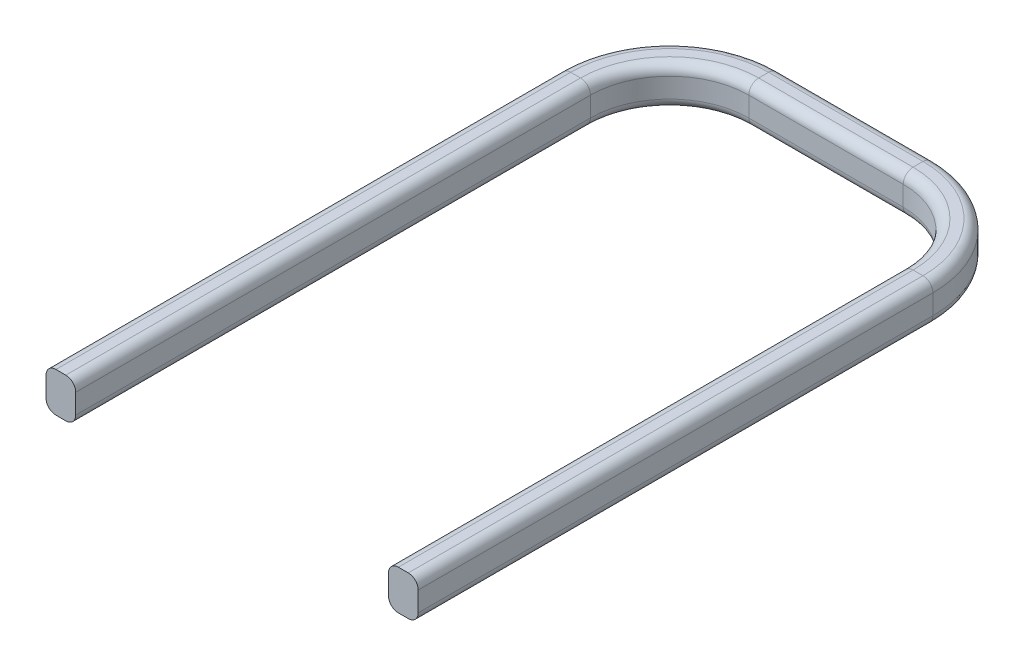
ISO-10303-21;
HEADER;
FILE_DESCRIPTION(('STEP AP214'),'2;1');
FILE_NAME('part.step','',(''),(''),'','','');
FILE_SCHEMA(('AUTOMOTIVE_DESIGN { 1 0 10303 214 1 1 1 1 }'));
ENDSEC;
DATA;
#1=APPLICATION_CONTEXT('core data for automotive mechanical design processes');
#2=APPLICATION_PROTOCOL_DEFINITION('international standard','automotive_design',2000,#1);
#3=PRODUCT_CONTEXT('',#1,'mechanical');
#4=PRODUCT('Part','Part','',(#3));
#5=PRODUCT_RELATED_PRODUCT_CATEGORY('part','',(#4));
#6=PRODUCT_DEFINITION_FORMATION('','',#4);
#7=PRODUCT_DEFINITION_CONTEXT('part definition',#1,'design');
#8=PRODUCT_DEFINITION('design','',#6,#7);
#9=PRODUCT_DEFINITION_SHAPE('','',#8);
#10=(LENGTH_UNIT() NAMED_UNIT(*) SI_UNIT(.MILLI.,.METRE.));
#11=(NAMED_UNIT(*) PLANE_ANGLE_UNIT() SI_UNIT($,.RADIAN.));
#12=(NAMED_UNIT(*) SI_UNIT($,.STERADIAN.) SOLID_ANGLE_UNIT());
#13=UNCERTAINTY_MEASURE_WITH_UNIT(LENGTH_MEASURE(1.E-05),#10,'distance_accuracy_value','');
#14=(GEOMETRIC_REPRESENTATION_CONTEXT(3) GLOBAL_UNCERTAINTY_ASSIGNED_CONTEXT((#13)) GLOBAL_UNIT_ASSIGNED_CONTEXT((#10,
#11,#12)) REPRESENTATION_CONTEXT('',''));
#15=CARTESIAN_POINT('',(0.,0.,0.));
#16=DIRECTION('',(0.,0.,1.));
#17=DIRECTION('',(1.,0.,0.));
#18=AXIS2_PLACEMENT_3D('',#15,#16,#17);
#19=CARTESIAN_POINT('',(0.,0.,0.));
#20=DIRECTION('',(0.,0.,-1.));
#21=DIRECTION('',(-1.,0.,0.));
#22=AXIS2_PLACEMENT_3D('',#19,#20,#21);
#23=PLANE('',#22);
#24=DIRECTION('',(0.,-1.,0.));
#25=VECTOR('',#24,1.);
#26=CARTESIAN_POINT('',(4.7,0.,0.));
#27=LINE('',#26,#25);
#28=CARTESIAN_POINT('',(4.7,0.75,0.));
#29=VERTEX_POINT('',#28);
#30=CARTESIAN_POINT('',(4.7,0.25,0.));
#31=VERTEX_POINT('',#30);
#32=EDGE_CURVE('E328',#29,#31,#27,.T.);
#33=ORIENTED_EDGE('',*,*,#32,.F.);
#34=CARTESIAN_POINT('',(4.45,0.75,0.));
#35=DIRECTION('',(0.,0.,-1.));
#36=DIRECTION('',(-1.,0.,0.));
#37=AXIS2_PLACEMENT_3D('',#34,#35,#36);
#38=CIRCLE('',#37,0.25);
#39=CARTESIAN_POINT('',(4.45,1.,0.));
#40=VERTEX_POINT('',#39);
#41=EDGE_CURVE('E210',#29,#40,#38,.F.);
#42=ORIENTED_EDGE('',*,*,#41,.T.);
#43=DIRECTION('',(1.,0.,0.));
#44=VECTOR('',#43,1.);
#45=CARTESIAN_POINT('',(3.95,1.,0.));
#46=LINE('',#45,#44);
#47=CARTESIAN_POINT('',(4.2,1.,0.));
#48=VERTEX_POINT('',#47);
#49=EDGE_CURVE('E324',#48,#40,#46,.T.);
#50=ORIENTED_EDGE('',*,*,#49,.F.);
#51=CARTESIAN_POINT('',(4.2,0.75,0.));
#52=DIRECTION('',(0.,0.,-1.));
#53=DIRECTION('',(-1.,0.,0.));
#54=AXIS2_PLACEMENT_3D('',#51,#52,#53);
#55=CIRCLE('',#54,0.25);
#56=CARTESIAN_POINT('',(3.95,0.75,0.));
#57=VERTEX_POINT('',#56);
#58=EDGE_CURVE('E230',#48,#57,#55,.F.);
#59=ORIENTED_EDGE('',*,*,#58,.T.);
#60=DIRECTION('',(0.,1.,0.));
#61=VECTOR('',#60,1.);
#62=CARTESIAN_POINT('',(3.95,0.,0.));
#63=LINE('',#62,#61);
#64=CARTESIAN_POINT('',(3.95,0.25,0.));
#65=VERTEX_POINT('',#64);
#66=EDGE_CURVE('E318',#65,#57,#63,.T.);
#67=ORIENTED_EDGE('',*,*,#66,.F.);
#68=CARTESIAN_POINT('',(4.2,0.25,0.));
#69=DIRECTION('',(0.,0.,-1.));
#70=DIRECTION('',(-1.,0.,0.));
#71=AXIS2_PLACEMENT_3D('',#68,#69,#70);
#72=CIRCLE('',#71,0.25);
#73=CARTESIAN_POINT('',(4.2,0.,0.));
#74=VERTEX_POINT('',#73);
#75=EDGE_CURVE('E392',#65,#74,#72,.F.);
#76=ORIENTED_EDGE('',*,*,#75,.T.);
#77=DIRECTION('',(-1.,0.,0.));
#78=VECTOR('',#77,1.);
#79=CARTESIAN_POINT('',(3.95,0.,0.));
#80=LINE('',#79,#78);
#81=CARTESIAN_POINT('',(4.45,0.,0.));
#82=VERTEX_POINT('',#81);
#83=EDGE_CURVE('E333',#82,#74,#80,.T.);
#84=ORIENTED_EDGE('',*,*,#83,.F.);
#85=CARTESIAN_POINT('',(4.45,0.25,0.));
#86=DIRECTION('',(0.,0.,-1.));
#87=DIRECTION('',(-1.,0.,0.));
#88=AXIS2_PLACEMENT_3D('',#85,#86,#87);
#89=CIRCLE('',#88,0.25);
#90=EDGE_CURVE('E394',#82,#31,#89,.F.);
#91=ORIENTED_EDGE('',*,*,#90,.T.);
#92=EDGE_LOOP('',(#33,#42,#50,#59,#67,#76,#84,#91));
#93=FACE_BOUND('',#92,.T.);
#94=ADVANCED_FACE('F34',(#93),#23,.F.);
#95=CARTESIAN_POINT('',(0.,0.,0.));
#96=DIRECTION('',(0.,0.,1.));
#97=DIRECTION('',(1.,0.,0.));
#98=AXIS2_PLACEMENT_3D('',#95,#96,#97);
#99=PLANE('',#98);
#100=DIRECTION('',(-1.,0.,0.));
#101=VECTOR('',#100,1.);
#102=CARTESIAN_POINT('',(-3.95,1.,0.));
#103=LINE('',#102,#101);
#104=CARTESIAN_POINT('',(-4.2,1.,0.));
#105=VERTEX_POINT('',#104);
#106=CARTESIAN_POINT('',(-4.45,1.,0.));
#107=VERTEX_POINT('',#106);
#108=EDGE_CURVE('E350',#105,#107,#103,.T.);
#109=ORIENTED_EDGE('',*,*,#108,.T.);
#110=CARTESIAN_POINT('',(-4.45,0.75,0.));
#111=DIRECTION('',(0.,0.,1.));
#112=DIRECTION('',(1.,0.,0.));
#113=AXIS2_PLACEMENT_3D('',#110,#111,#112);
#114=CIRCLE('',#113,0.25);
#115=CARTESIAN_POINT('',(-4.7,0.75,0.));
#116=VERTEX_POINT('',#115);
#117=EDGE_CURVE('E459',#107,#116,#114,.T.);
#118=ORIENTED_EDGE('',*,*,#117,.T.);
#119=DIRECTION('',(0.,-1.,0.));
#120=VECTOR('',#119,1.);
#121=CARTESIAN_POINT('',(-4.7,0.,0.));
#122=LINE('',#121,#120);
#123=CARTESIAN_POINT('',(-4.7,0.25,0.));
#124=VERTEX_POINT('',#123);
#125=EDGE_CURVE('E363',#116,#124,#122,.T.);
#126=ORIENTED_EDGE('',*,*,#125,.T.);
#127=CARTESIAN_POINT('',(-4.45,0.25,0.));
#128=DIRECTION('',(0.,0.,1.));
#129=DIRECTION('',(1.,0.,0.));
#130=AXIS2_PLACEMENT_3D('',#127,#128,#129);
#131=CIRCLE('',#130,0.25);
#132=CARTESIAN_POINT('',(-4.45,0.,0.));
#133=VERTEX_POINT('',#132);
#134=EDGE_CURVE('E58',#124,#133,#131,.T.);
#135=ORIENTED_EDGE('',*,*,#134,.T.);
#136=DIRECTION('',(1.,0.,0.));
#137=VECTOR('',#136,1.);
#138=CARTESIAN_POINT('',(-3.95,0.,0.));
#139=LINE('',#138,#137);
#140=CARTESIAN_POINT('',(-4.2,0.,0.));
#141=VERTEX_POINT('',#140);
#142=EDGE_CURVE('E231',#133,#141,#139,.T.);
#143=ORIENTED_EDGE('',*,*,#142,.T.);
#144=CARTESIAN_POINT('',(-4.2,0.25,0.));
#145=DIRECTION('',(0.,0.,1.));
#146=DIRECTION('',(1.,0.,0.));
#147=AXIS2_PLACEMENT_3D('',#144,#145,#146);
#148=CIRCLE('',#147,0.25);
#149=CARTESIAN_POINT('',(-3.95,0.25,0.));
#150=VERTEX_POINT('',#149);
#151=EDGE_CURVE('E456',#141,#150,#148,.T.);
#152=ORIENTED_EDGE('',*,*,#151,.T.);
#153=DIRECTION('',(0.,1.,0.));
#154=VECTOR('',#153,1.);
#155=CARTESIAN_POINT('',(-3.95,0.,0.));
#156=LINE('',#155,#154);
#157=CARTESIAN_POINT('',(-3.95,0.75,0.));
#158=VERTEX_POINT('',#157);
#159=EDGE_CURVE('E348',#150,#158,#156,.T.);
#160=ORIENTED_EDGE('',*,*,#159,.T.);
#161=CARTESIAN_POINT('',(-4.2,0.75,0.));
#162=DIRECTION('',(0.,0.,1.));
#163=DIRECTION('',(1.,0.,0.));
#164=AXIS2_PLACEMENT_3D('',#161,#162,#163);
#165=CIRCLE('',#164,0.25);
#166=EDGE_CURVE('E454',#158,#105,#165,.T.);
#167=ORIENTED_EDGE('',*,*,#166,.T.);
#168=EDGE_LOOP('',(#109,#118,#126,#135,#143,#152,#160,#167));
#169=FACE_BOUND('',#168,.T.);
#170=ADVANCED_FACE('F475',(#169),#99,.T.);
#171=CARTESIAN_POINT('',(3.95,0.,0.));
#172=DIRECTION('',(-1.,0.,0.));
#173=DIRECTION('',(0.,0.,1.));
#174=AXIS2_PLACEMENT_3D('',#171,#172,#173);
#175=PLANE('',#174);
#176=DIRECTION('',(0.,1.,0.));
#177=VECTOR('',#176,1.);
#178=CARTESIAN_POINT('',(3.95,0.,-13.));
#179=LINE('',#178,#177);
#180=CARTESIAN_POINT('',(3.95,0.25,-13.));
#181=VERTEX_POINT('',#180);
#182=CARTESIAN_POINT('',(3.95,0.75,-13.));
#183=VERTEX_POINT('',#182);
#184=EDGE_CURVE('E222',#181,#183,#179,.T.);
#185=ORIENTED_EDGE('',*,*,#184,.F.);
#186=DIRECTION('',(0.,0.,-1.));
#187=VECTOR('',#186,1.);
#188=CARTESIAN_POINT('',(3.95,0.25,0.));
#189=LINE('',#188,#187);
#190=EDGE_CURVE('E437',#181,#65,#189,.F.);
#191=ORIENTED_EDGE('',*,*,#190,.T.);
#192=ORIENTED_EDGE('',*,*,#66,.T.);
#193=DIRECTION('',(0.,0.,-1.));
#194=VECTOR('',#193,1.);
#195=CARTESIAN_POINT('',(3.95,0.75,0.));
#196=LINE('',#195,#194);
#197=EDGE_CURVE('E435',#57,#183,#196,.T.);
#198=ORIENTED_EDGE('',*,*,#197,.T.);
#199=EDGE_LOOP('',(#185,#191,#192,#198));
#200=FACE_BOUND('',#199,.T.);
#201=ADVANCED_FACE('F532',(#200),#175,.T.);
#202=CARTESIAN_POINT('',(3.95,1.,0.));
#203=DIRECTION('',(0.,1.,0.));
#204=DIRECTION('',(-1.,0.,0.));
#205=AXIS2_PLACEMENT_3D('',#202,#203,#204);
#206=PLANE('',#205);
#207=ORIENTED_EDGE('',*,*,#49,.T.);
#208=DIRECTION('',(0.,0.,-1.));
#209=VECTOR('',#208,1.);
#210=CARTESIAN_POINT('',(4.45,1.,0.));
#211=LINE('',#210,#209);
#212=CARTESIAN_POINT('',(4.45,1.,-13.));
#213=VERTEX_POINT('',#212);
#214=EDGE_CURVE('E220',#40,#213,#211,.T.);
#215=ORIENTED_EDGE('',*,*,#214,.T.);
#216=DIRECTION('',(1.,0.,0.));
#217=VECTOR('',#216,1.);
#218=CARTESIAN_POINT('',(3.95,1.,-13.));
#219=LINE('',#218,#217);
#220=CARTESIAN_POINT('',(4.2,1.,-13.));
#221=VERTEX_POINT('',#220);
#222=EDGE_CURVE('E202',#221,#213,#219,.T.);
#223=ORIENTED_EDGE('',*,*,#222,.F.);
#224=DIRECTION('',(0.,0.,-1.));
#225=VECTOR('',#224,1.);
#226=CARTESIAN_POINT('',(4.2,1.,0.));
#227=LINE('',#226,#225);
#228=EDGE_CURVE('E217',#221,#48,#227,.F.);
#229=ORIENTED_EDGE('',*,*,#228,.T.);
#230=EDGE_LOOP('',(#207,#215,#223,#229));
#231=FACE_BOUND('',#230,.T.);
#232=ADVANCED_FACE('F216',(#231),#206,.T.);
#233=CARTESIAN_POINT('',(4.7,0.,0.));
#234=DIRECTION('',(1.,0.,0.));
#235=DIRECTION('',(0.,0.,-1.));
#236=AXIS2_PLACEMENT_3D('',#233,#234,#235);
#237=PLANE('',#236);
#238=DIRECTION('',(0.,-1.,0.));
#239=VECTOR('',#238,1.);
#240=CARTESIAN_POINT('',(4.7,0.,-13.));
#241=LINE('',#240,#239);
#242=CARTESIAN_POINT('',(4.7,0.75,-13.));
#243=VERTEX_POINT('',#242);
#244=CARTESIAN_POINT('',(4.7,0.25,-13.));
#245=VERTEX_POINT('',#244);
#246=EDGE_CURVE('E221',#243,#245,#241,.T.);
#247=ORIENTED_EDGE('',*,*,#246,.F.);
#248=DIRECTION('',(0.,0.,-1.));
#249=VECTOR('',#248,1.);
#250=CARTESIAN_POINT('',(4.7,0.75,0.));
#251=LINE('',#250,#249);
#252=EDGE_CURVE('E389',#243,#29,#251,.F.);
#253=ORIENTED_EDGE('',*,*,#252,.T.);
#254=ORIENTED_EDGE('',*,*,#32,.T.);
#255=DIRECTION('',(0.,0.,-1.));
#256=VECTOR('',#255,1.);
#257=CARTESIAN_POINT('',(4.7,0.25,0.));
#258=LINE('',#257,#256);
#259=EDGE_CURVE('E386',#31,#245,#258,.T.);
#260=ORIENTED_EDGE('',*,*,#259,.T.);
#261=EDGE_LOOP('',(#247,#253,#254,#260));
#262=FACE_BOUND('',#261,.T.);
#263=ADVANCED_FACE('F502',(#262),#237,.T.);
#264=CARTESIAN_POINT('',(3.95,0.,0.));
#265=DIRECTION('',(0.,-1.,0.));
#266=DIRECTION('',(1.,0.,0.));
#267=AXIS2_PLACEMENT_3D('',#264,#265,#266);
#268=PLANE('',#267);
#269=DIRECTION('',(-1.,0.,0.));
#270=VECTOR('',#269,1.);
#271=CARTESIAN_POINT('',(3.95,0.,-13.));
#272=LINE('',#271,#270);
#273=CARTESIAN_POINT('',(4.45,0.,-13.));
#274=VERTEX_POINT('',#273);
#275=CARTESIAN_POINT('',(4.2,0.,-13.));
#276=VERTEX_POINT('',#275);
#277=EDGE_CURVE('E337',#274,#276,#272,.T.);
#278=ORIENTED_EDGE('',*,*,#277,.F.);
#279=DIRECTION('',(0.,0.,-1.));
#280=VECTOR('',#279,1.);
#281=CARTESIAN_POINT('',(4.45,0.,0.));
#282=LINE('',#281,#280);
#283=EDGE_CURVE('E421',#274,#82,#282,.F.);
#284=ORIENTED_EDGE('',*,*,#283,.T.);
#285=ORIENTED_EDGE('',*,*,#83,.T.);
#286=DIRECTION('',(0.,0.,-1.));
#287=VECTOR('',#286,1.);
#288=CARTESIAN_POINT('',(4.2,0.,0.));
#289=LINE('',#288,#287);
#290=EDGE_CURVE('E418',#74,#276,#289,.T.);
#291=ORIENTED_EDGE('',*,*,#290,.T.);
#292=EDGE_LOOP('',(#278,#284,#285,#291));
#293=FACE_BOUND('',#292,.T.);
#294=ADVANCED_FACE('F512',(#293),#268,.T.);
#295=CARTESIAN_POINT('',(1.95,0.,-13.));
#296=DIRECTION('',(0.,1.,0.));
#297=DIRECTION('',(0.,0.,1.));
#298=AXIS2_PLACEMENT_3D('',#295,#296,#297);
#299=CYLINDRICAL_SURFACE('',#298,2.);
#300=DIRECTION('',(0.,1.,0.));
#301=VECTOR('',#300,1.);
#302=CARTESIAN_POINT('',(1.95,0.,-15.));
#303=LINE('',#302,#301);
#304=CARTESIAN_POINT('',(1.95,0.25,-15.));
#305=VERTEX_POINT('',#304);
#306=CARTESIAN_POINT('',(1.95,0.75,-15.));
#307=VERTEX_POINT('',#306);
#308=EDGE_CURVE('E334',#305,#307,#303,.T.);
#309=ORIENTED_EDGE('',*,*,#308,.F.);
#310=CARTESIAN_POINT('',(1.95,0.25,-13.));
#311=DIRECTION('',(0.,-1.,0.));
#312=DIRECTION('',(0.,0.,-1.));
#313=AXIS2_PLACEMENT_3D('',#310,#311,#312);
#314=CIRCLE('',#313,2.);
#315=EDGE_CURVE('E440',#305,#181,#314,.T.);
#316=ORIENTED_EDGE('',*,*,#315,.T.);
#317=ORIENTED_EDGE('',*,*,#184,.T.);
#318=CARTESIAN_POINT('',(1.95,0.75,-13.));
#319=DIRECTION('',(0.,1.,0.));
#320=DIRECTION('',(0.,0.,1.));
#321=AXIS2_PLACEMENT_3D('',#318,#319,#320);
#322=CIRCLE('',#321,2.);
#323=EDGE_CURVE('E234',#183,#307,#322,.T.);
#324=ORIENTED_EDGE('',*,*,#323,.T.);
#325=EDGE_LOOP('',(#309,#316,#317,#324));
#326=FACE_BOUND('',#325,.T.);
#327=ADVANCED_FACE('F531',(#326),#299,.F.);
#328=CARTESIAN_POINT('',(3.95,1.,-13.));
#329=DIRECTION('',(0.,1.,0.));
#330=DIRECTION('',(0.,0.,1.));
#331=AXIS2_PLACEMENT_3D('',#328,#329,#330);
#332=PLANE('',#331);
#333=ORIENTED_EDGE('',*,*,#222,.T.);
#334=CARTESIAN_POINT('',(1.95,1.,-13.));
#335=DIRECTION('',(0.,1.,0.));
#336=DIRECTION('',(0.,0.,1.));
#337=AXIS2_PLACEMENT_3D('',#334,#335,#336);
#338=CIRCLE('',#337,2.5);
#339=CARTESIAN_POINT('',(1.95,1.,-15.5));
#340=VERTEX_POINT('',#339);
#341=EDGE_CURVE('E209',#213,#340,#338,.T.);
#342=ORIENTED_EDGE('',*,*,#341,.T.);
#343=DIRECTION('',(0.,0.,-1.));
#344=VECTOR('',#343,1.);
#345=CARTESIAN_POINT('',(1.95,1.,-15.));
#346=LINE('',#345,#344);
#347=CARTESIAN_POINT('',(1.95,1.,-15.25));
#348=VERTEX_POINT('',#347);
#349=EDGE_CURVE('E204',#348,#340,#346,.T.);
#350=ORIENTED_EDGE('',*,*,#349,.F.);
#351=CARTESIAN_POINT('',(1.95,1.,-13.));
#352=DIRECTION('',(0.,1.,0.));
#353=DIRECTION('',(0.,0.,1.));
#354=AXIS2_PLACEMENT_3D('',#351,#352,#353);
#355=CIRCLE('',#354,2.25);
#356=EDGE_CURVE('E199',#348,#221,#355,.F.);
#357=ORIENTED_EDGE('',*,*,#356,.T.);
#358=EDGE_LOOP('',(#333,#342,#350,#357));
#359=FACE_BOUND('',#358,.T.);
#360=ADVANCED_FACE('F201',(#359),#332,.T.);
#361=CARTESIAN_POINT('',(1.95,0.,-13.));
#362=DIRECTION('',(0.,1.,0.));
#363=DIRECTION('',(0.,0.,1.));
#364=AXIS2_PLACEMENT_3D('',#361,#362,#363);
#365=CYLINDRICAL_SURFACE('',#364,2.75);
#366=DIRECTION('',(0.,-1.,0.));
#367=VECTOR('',#366,1.);
#368=CARTESIAN_POINT('',(1.95,0.,-15.75));
#369=LINE('',#368,#367);
#370=CARTESIAN_POINT('',(1.95,0.75,-15.75));
#371=VERTEX_POINT('',#370);
#372=CARTESIAN_POINT('',(1.95,0.25,-15.75));
#373=VERTEX_POINT('',#372);
#374=EDGE_CURVE('E354',#371,#373,#369,.T.);
#375=ORIENTED_EDGE('',*,*,#374,.F.);
#376=CARTESIAN_POINT('',(1.95,0.75,-13.));
#377=DIRECTION('',(0.,1.,0.));
#378=DIRECTION('',(0.,0.,1.));
#379=AXIS2_PLACEMENT_3D('',#376,#377,#378);
#380=CIRCLE('',#379,2.75);
#381=EDGE_CURVE('E400',#371,#243,#380,.F.);
#382=ORIENTED_EDGE('',*,*,#381,.T.);
#383=ORIENTED_EDGE('',*,*,#246,.T.);
#384=CARTESIAN_POINT('',(1.95,0.25,-13.));
#385=DIRECTION('',(0.,-1.,0.));
#386=DIRECTION('',(0.,0.,-1.));
#387=AXIS2_PLACEMENT_3D('',#384,#385,#386);
#388=CIRCLE('',#387,2.75);
#389=EDGE_CURVE('E398',#245,#373,#388,.F.);
#390=ORIENTED_EDGE('',*,*,#389,.T.);
#391=EDGE_LOOP('',(#375,#382,#383,#390));
#392=FACE_BOUND('',#391,.T.);
#393=ADVANCED_FACE('F495',(#392),#365,.T.);
#394=CARTESIAN_POINT('',(3.95,0.,-13.));
#395=DIRECTION('',(0.,-1.,0.));
#396=DIRECTION('',(0.,0.,-1.));
#397=AXIS2_PLACEMENT_3D('',#394,#395,#396);
#398=PLANE('',#397);
#399=DIRECTION('',(0.,0.,1.));
#400=VECTOR('',#399,1.);
#401=CARTESIAN_POINT('',(1.95,0.,-15.));
#402=LINE('',#401,#400);
#403=CARTESIAN_POINT('',(1.95,0.,-15.5));
#404=VERTEX_POINT('',#403);
#405=CARTESIAN_POINT('',(1.95,0.,-15.25));
#406=VERTEX_POINT('',#405);
#407=EDGE_CURVE('E342',#404,#406,#402,.T.);
#408=ORIENTED_EDGE('',*,*,#407,.F.);
#409=CARTESIAN_POINT('',(1.95,0.,-13.));
#410=DIRECTION('',(0.,-1.,0.));
#411=DIRECTION('',(0.,0.,-1.));
#412=AXIS2_PLACEMENT_3D('',#409,#410,#411);
#413=CIRCLE('',#412,2.5);
#414=EDGE_CURVE('E425',#404,#274,#413,.T.);
#415=ORIENTED_EDGE('',*,*,#414,.T.);
#416=ORIENTED_EDGE('',*,*,#277,.T.);
#417=CARTESIAN_POINT('',(1.95,0.,-13.));
#418=DIRECTION('',(0.,-1.,0.));
#419=DIRECTION('',(0.,0.,-1.));
#420=AXIS2_PLACEMENT_3D('',#417,#418,#419);
#421=CIRCLE('',#420,2.25);
#422=EDGE_CURVE('E423',#276,#406,#421,.F.);
#423=ORIENTED_EDGE('',*,*,#422,.T.);
#424=EDGE_LOOP('',(#408,#415,#416,#423));
#425=FACE_BOUND('',#424,.T.);
#426=ADVANCED_FACE('F521',(#425),#398,.T.);
#427=CARTESIAN_POINT('',(1.94999999999999,0.,-15.));
#428=DIRECTION('',(0.,0.,1.));
#429=DIRECTION('',(1.,0.,0.));
#430=AXIS2_PLACEMENT_3D('',#427,#428,#429);
#431=PLANE('',#430);
#432=DIRECTION('',(0.,1.,0.));
#433=VECTOR('',#432,1.);
#434=CARTESIAN_POINT('',(-1.94999999999999,0.,-15.));
#435=LINE('',#434,#433);
#436=CARTESIAN_POINT('',(-1.94999999999999,0.25,-15.));
#437=VERTEX_POINT('',#436);
#438=CARTESIAN_POINT('',(-1.94999999999999,0.75,-15.));
#439=VERTEX_POINT('',#438);
#440=EDGE_CURVE('E338',#437,#439,#435,.T.);
#441=ORIENTED_EDGE('',*,*,#440,.F.);
#442=DIRECTION('',(-1.,0.,0.));
#443=VECTOR('',#442,1.);
#444=CARTESIAN_POINT('',(1.94999999999999,0.25,-15.));
#445=LINE('',#444,#443);
#446=EDGE_CURVE('E444',#437,#305,#445,.F.);
#447=ORIENTED_EDGE('',*,*,#446,.T.);
#448=ORIENTED_EDGE('',*,*,#308,.T.);
#449=DIRECTION('',(-1.,0.,0.));
#450=VECTOR('',#449,1.);
#451=CARTESIAN_POINT('',(1.94999999999999,0.75,-15.));
#452=LINE('',#451,#450);
#453=EDGE_CURVE('E442',#307,#439,#452,.T.);
#454=ORIENTED_EDGE('',*,*,#453,.T.);
#455=EDGE_LOOP('',(#441,#447,#448,#454));
#456=FACE_BOUND('',#455,.T.);
#457=ADVANCED_FACE('F529',(#456),#431,.T.);
#458=CARTESIAN_POINT('',(1.94999999999999,1.,-15.));
#459=DIRECTION('',(0.,1.,0.));
#460=DIRECTION('',(0.,0.,1.));
#461=AXIS2_PLACEMENT_3D('',#458,#459,#460);
#462=PLANE('',#461);
#463=ORIENTED_EDGE('',*,*,#349,.T.);
#464=DIRECTION('',(-1.,0.,0.));
#465=VECTOR('',#464,1.);
#466=CARTESIAN_POINT('',(1.94999999999999,1.,-15.5));
#467=LINE('',#466,#465);
#468=CARTESIAN_POINT('',(-1.94999999999999,1.,-15.5));
#469=VERTEX_POINT('',#468);
#470=EDGE_CURVE('E404',#340,#469,#467,.T.);
#471=ORIENTED_EDGE('',*,*,#470,.T.);
#472=DIRECTION('',(0.,0.,-1.));
#473=VECTOR('',#472,1.);
#474=CARTESIAN_POINT('',(-1.94999999999999,1.,-15.));
#475=LINE('',#474,#473);
#476=CARTESIAN_POINT('',(-1.94999999999999,1.,-15.25));
#477=VERTEX_POINT('',#476);
#478=EDGE_CURVE('E341',#477,#469,#475,.T.);
#479=ORIENTED_EDGE('',*,*,#478,.F.);
#480=DIRECTION('',(-1.,0.,0.));
#481=VECTOR('',#480,1.);
#482=CARTESIAN_POINT('',(1.94999999999999,1.,-15.25));
#483=LINE('',#482,#481);
#484=EDGE_CURVE('E402',#477,#348,#483,.F.);
#485=ORIENTED_EDGE('',*,*,#484,.T.);
#486=EDGE_LOOP('',(#463,#471,#479,#485));
#487=FACE_BOUND('',#486,.T.);
#488=ADVANCED_FACE('F750',(#487),#462,.T.);
#489=CARTESIAN_POINT('',(1.94999999999999,0.,-15.75));
#490=DIRECTION('',(0.,0.,-1.));
#491=DIRECTION('',(-1.,0.,0.));
#492=AXIS2_PLACEMENT_3D('',#489,#490,#491);
#493=PLANE('',#492);
#494=DIRECTION('',(0.,-1.,0.));
#495=VECTOR('',#494,1.);
#496=CARTESIAN_POINT('',(-1.94999999999999,0.,-15.75));
#497=LINE('',#496,#495);
#498=CARTESIAN_POINT('',(-1.94999999999999,0.75,-15.75));
#499=VERTEX_POINT('',#498);
#500=CARTESIAN_POINT('',(-1.94999999999999,0.25,-15.75));
#501=VERTEX_POINT('',#500);
#502=EDGE_CURVE('E357',#499,#501,#497,.T.);
#503=ORIENTED_EDGE('',*,*,#502,.F.);
#504=DIRECTION('',(-1.,0.,0.));
#505=VECTOR('',#504,1.);
#506=CARTESIAN_POINT('',(1.94999999999999,0.75,-15.75));
#507=LINE('',#506,#505);
#508=EDGE_CURVE('E408',#499,#371,#507,.F.);
#509=ORIENTED_EDGE('',*,*,#508,.T.);
#510=ORIENTED_EDGE('',*,*,#374,.T.);
#511=DIRECTION('',(-1.,0.,0.));
#512=VECTOR('',#511,1.);
#513=CARTESIAN_POINT('',(1.94999999999999,0.25,-15.75));
#514=LINE('',#513,#512);
#515=EDGE_CURVE('E406',#373,#501,#514,.T.);
#516=ORIENTED_EDGE('',*,*,#515,.T.);
#517=EDGE_LOOP('',(#503,#509,#510,#516));
#518=FACE_BOUND('',#517,.T.);
#519=ADVANCED_FACE('F493',(#518),#493,.T.);
#520=CARTESIAN_POINT('',(1.94999999999999,0.,-15.));
#521=DIRECTION('',(0.,-1.,0.));
#522=DIRECTION('',(0.,0.,-1.));
#523=AXIS2_PLACEMENT_3D('',#520,#521,#522);
#524=PLANE('',#523);
#525=DIRECTION('',(0.,0.,1.));
#526=VECTOR('',#525,1.);
#527=CARTESIAN_POINT('',(-1.94999999999999,0.,-15.));
#528=LINE('',#527,#526);
#529=CARTESIAN_POINT('',(-1.94999999999999,0.,-15.5));
#530=VERTEX_POINT('',#529);
#531=CARTESIAN_POINT('',(-1.94999999999999,0.,-15.25));
#532=VERTEX_POINT('',#531);
#533=EDGE_CURVE('E347',#530,#532,#528,.T.);
#534=ORIENTED_EDGE('',*,*,#533,.F.);
#535=DIRECTION('',(-1.,0.,0.));
#536=VECTOR('',#535,1.);
#537=CARTESIAN_POINT('',(1.94999999999999,0.,-15.5));
#538=LINE('',#537,#536);
#539=EDGE_CURVE('E429',#530,#404,#538,.F.);
#540=ORIENTED_EDGE('',*,*,#539,.T.);
#541=ORIENTED_EDGE('',*,*,#407,.T.);
#542=DIRECTION('',(-1.,0.,0.));
#543=VECTOR('',#542,1.);
#544=CARTESIAN_POINT('',(1.94999999999999,0.,-15.25));
#545=LINE('',#544,#543);
#546=EDGE_CURVE('E427',#406,#532,#545,.T.);
#547=ORIENTED_EDGE('',*,*,#546,.T.);
#548=EDGE_LOOP('',(#534,#540,#541,#547));
#549=FACE_BOUND('',#548,.T.);
#550=ADVANCED_FACE('F524',(#549),#524,.T.);
#551=CARTESIAN_POINT('',(-1.95,0.,-13.));
#552=DIRECTION('',(0.,1.,0.));
#553=DIRECTION('',(0.,0.,1.));
#554=AXIS2_PLACEMENT_3D('',#551,#552,#553);
#555=CYLINDRICAL_SURFACE('',#554,2.);
#556=DIRECTION('',(0.,1.,0.));
#557=VECTOR('',#556,1.);
#558=CARTESIAN_POINT('',(-3.95,0.,-13.));
#559=LINE('',#558,#557);
#560=CARTESIAN_POINT('',(-3.95,0.25,-13.));
#561=VERTEX_POINT('',#560);
#562=CARTESIAN_POINT('',(-3.95,0.75,-13.));
#563=VERTEX_POINT('',#562);
#564=EDGE_CURVE('E343',#561,#563,#559,.T.);
#565=ORIENTED_EDGE('',*,*,#564,.F.);
#566=CARTESIAN_POINT('',(-1.95,0.25,-13.));
#567=DIRECTION('',(0.,-1.,0.));
#568=DIRECTION('',(0.,0.,-1.));
#569=AXIS2_PLACEMENT_3D('',#566,#567,#568);
#570=CIRCLE('',#569,2.);
#571=EDGE_CURVE('E448',#561,#437,#570,.T.);
#572=ORIENTED_EDGE('',*,*,#571,.T.);
#573=ORIENTED_EDGE('',*,*,#440,.T.);
#574=CARTESIAN_POINT('',(-1.95,0.75,-13.));
#575=DIRECTION('',(0.,1.,0.));
#576=DIRECTION('',(0.,0.,1.));
#577=AXIS2_PLACEMENT_3D('',#574,#575,#576);
#578=CIRCLE('',#577,2.);
#579=EDGE_CURVE('E446',#439,#563,#578,.T.);
#580=ORIENTED_EDGE('',*,*,#579,.T.);
#581=EDGE_LOOP('',(#565,#572,#573,#580));
#582=FACE_BOUND('',#581,.T.);
#583=ADVANCED_FACE('F725',(#582),#555,.F.);
#584=CARTESIAN_POINT('',(-1.94999999999999,1.,-15.));
#585=DIRECTION('',(0.,1.,0.));
#586=DIRECTION('',(0.,0.,1.));
#587=AXIS2_PLACEMENT_3D('',#584,#585,#586);
#588=PLANE('',#587);
#589=ORIENTED_EDGE('',*,*,#478,.T.);
#590=CARTESIAN_POINT('',(-1.95,1.,-13.));
#591=DIRECTION('',(0.,1.,0.));
#592=DIRECTION('',(0.,0.,1.));
#593=AXIS2_PLACEMENT_3D('',#590,#591,#592);
#594=CIRCLE('',#593,2.5);
#595=CARTESIAN_POINT('',(-4.45,1.,-13.));
#596=VERTEX_POINT('',#595);
#597=EDGE_CURVE('E412',#469,#596,#594,.T.);
#598=ORIENTED_EDGE('',*,*,#597,.T.);
#599=DIRECTION('',(-1.,0.,0.));
#600=VECTOR('',#599,1.);
#601=CARTESIAN_POINT('',(-3.95,1.,-13.));
#602=LINE('',#601,#600);
#603=CARTESIAN_POINT('',(-4.2,1.,-13.));
#604=VERTEX_POINT('',#603);
#605=EDGE_CURVE('E346',#604,#596,#602,.T.);
#606=ORIENTED_EDGE('',*,*,#605,.F.);
#607=CARTESIAN_POINT('',(-1.95,1.,-13.));
#608=DIRECTION('',(0.,1.,0.));
#609=DIRECTION('',(0.,0.,1.));
#610=AXIS2_PLACEMENT_3D('',#607,#608,#609);
#611=CIRCLE('',#610,2.25);
#612=EDGE_CURVE('E410',#604,#477,#611,.F.);
#613=ORIENTED_EDGE('',*,*,#612,.T.);
#614=EDGE_LOOP('',(#589,#598,#606,#613));
#615=FACE_BOUND('',#614,.T.);
#616=ADVANCED_FACE('F484',(#615),#588,.T.);
#617=CARTESIAN_POINT('',(-1.95,0.,-13.));
#618=DIRECTION('',(0.,1.,0.));
#619=DIRECTION('',(0.,0.,1.));
#620=AXIS2_PLACEMENT_3D('',#617,#618,#619);
#621=CYLINDRICAL_SURFACE('',#620,2.75);
#622=DIRECTION('',(0.,-1.,0.));
#623=VECTOR('',#622,1.);
#624=CARTESIAN_POINT('',(-4.7,0.,-13.));
#625=LINE('',#624,#623);
#626=CARTESIAN_POINT('',(-4.7,0.75,-13.));
#627=VERTEX_POINT('',#626);
#628=CARTESIAN_POINT('',(-4.7,0.25,-13.));
#629=VERTEX_POINT('',#628);
#630=EDGE_CURVE('E360',#627,#629,#625,.T.);
#631=ORIENTED_EDGE('',*,*,#630,.F.);
#632=CARTESIAN_POINT('',(-1.95,0.75,-13.));
#633=DIRECTION('',(0.,1.,0.));
#634=DIRECTION('',(0.,0.,1.));
#635=AXIS2_PLACEMENT_3D('',#632,#633,#634);
#636=CIRCLE('',#635,2.75);
#637=EDGE_CURVE('E416',#627,#499,#636,.F.);
#638=ORIENTED_EDGE('',*,*,#637,.T.);
#639=ORIENTED_EDGE('',*,*,#502,.T.);
#640=CARTESIAN_POINT('',(-1.95,0.25,-13.));
#641=DIRECTION('',(0.,-1.,0.));
#642=DIRECTION('',(0.,0.,-1.));
#643=AXIS2_PLACEMENT_3D('',#640,#641,#642);
#644=CIRCLE('',#643,2.75);
#645=EDGE_CURVE('E414',#501,#629,#644,.F.);
#646=ORIENTED_EDGE('',*,*,#645,.T.);
#647=EDGE_LOOP('',(#631,#638,#639,#646));
#648=FACE_BOUND('',#647,.T.);
#649=ADVANCED_FACE('F707',(#648),#621,.T.);
#650=CARTESIAN_POINT('',(-1.94999999999999,0.,-15.));
#651=DIRECTION('',(0.,-1.,0.));
#652=DIRECTION('',(0.,0.,-1.));
#653=AXIS2_PLACEMENT_3D('',#650,#651,#652);
#654=PLANE('',#653);
#655=DIRECTION('',(1.,0.,0.));
#656=VECTOR('',#655,1.);
#657=CARTESIAN_POINT('',(-3.95,0.,-13.));
#658=LINE('',#657,#656);
#659=CARTESIAN_POINT('',(-4.45,0.,-13.));
#660=VERTEX_POINT('',#659);
#661=CARTESIAN_POINT('',(-4.2,0.,-13.));
#662=VERTEX_POINT('',#661);
#663=EDGE_CURVE('E351',#660,#662,#658,.T.);
#664=ORIENTED_EDGE('',*,*,#663,.F.);
#665=CARTESIAN_POINT('',(-1.95,0.,-13.));
#666=DIRECTION('',(0.,-1.,0.));
#667=DIRECTION('',(0.,0.,-1.));
#668=AXIS2_PLACEMENT_3D('',#665,#666,#667);
#669=CIRCLE('',#668,2.5);
#670=EDGE_CURVE('E433',#660,#530,#669,.T.);
#671=ORIENTED_EDGE('',*,*,#670,.T.);
#672=ORIENTED_EDGE('',*,*,#533,.T.);
#673=CARTESIAN_POINT('',(-1.95,0.,-13.));
#674=DIRECTION('',(0.,-1.,0.));
#675=DIRECTION('',(0.,0.,-1.));
#676=AXIS2_PLACEMENT_3D('',#673,#674,#675);
#677=CIRCLE('',#676,2.25);
#678=EDGE_CURVE('E431',#532,#662,#677,.F.);
#679=ORIENTED_EDGE('',*,*,#678,.T.);
#680=EDGE_LOOP('',(#664,#671,#672,#679));
#681=FACE_BOUND('',#680,.T.);
#682=ADVANCED_FACE('F556',(#681),#654,.T.);
#683=CARTESIAN_POINT('',(-3.95,0.,-13.));
#684=DIRECTION('',(1.,0.,0.));
#685=DIRECTION('',(0.,0.,-1.));
#686=AXIS2_PLACEMENT_3D('',#683,#684,#685);
#687=PLANE('',#686);
#688=ORIENTED_EDGE('',*,*,#159,.F.);
#689=DIRECTION('',(0.,0.,1.));
#690=VECTOR('',#689,1.);
#691=CARTESIAN_POINT('',(-3.95,0.25,-13.));
#692=LINE('',#691,#690);
#693=EDGE_CURVE('E11',#150,#561,#692,.F.);
#694=ORIENTED_EDGE('',*,*,#693,.T.);
#695=ORIENTED_EDGE('',*,*,#564,.T.);
#696=DIRECTION('',(0.,0.,1.));
#697=VECTOR('',#696,1.);
#698=CARTESIAN_POINT('',(-3.95,0.75,-13.));
#699=LINE('',#698,#697);
#700=EDGE_CURVE('E43',#563,#158,#699,.T.);
#701=ORIENTED_EDGE('',*,*,#700,.T.);
#702=EDGE_LOOP('',(#688,#694,#695,#701));
#703=FACE_BOUND('',#702,.T.);
#704=ADVANCED_FACE('F470',(#703),#687,.T.);
#705=CARTESIAN_POINT('',(-3.95,1.,-13.));
#706=DIRECTION('',(0.,1.,0.));
#707=DIRECTION('',(-1.,0.,0.));
#708=AXIS2_PLACEMENT_3D('',#705,#706,#707);
#709=PLANE('',#708);
#710=ORIENTED_EDGE('',*,*,#605,.T.);
#711=DIRECTION('',(0.,0.,1.));
#712=VECTOR('',#711,1.);
#713=CARTESIAN_POINT('',(-4.45,1.,-13.));
#714=LINE('',#713,#712);
#715=EDGE_CURVE('E452',#596,#107,#714,.T.);
#716=ORIENTED_EDGE('',*,*,#715,.T.);
#717=ORIENTED_EDGE('',*,*,#108,.F.);
#718=DIRECTION('',(0.,0.,1.));
#719=VECTOR('',#718,1.);
#720=CARTESIAN_POINT('',(-4.2,1.,-13.));
#721=LINE('',#720,#719);
#722=EDGE_CURVE('E450',#105,#604,#721,.F.);
#723=ORIENTED_EDGE('',*,*,#722,.T.);
#724=EDGE_LOOP('',(#710,#716,#717,#723));
#725=FACE_BOUND('',#724,.T.);
#726=ADVANCED_FACE('F481',(#725),#709,.T.);
#727=CARTESIAN_POINT('',(-4.7,0.,-13.));
#728=DIRECTION('',(-1.,0.,0.));
#729=DIRECTION('',(0.,0.,1.));
#730=AXIS2_PLACEMENT_3D('',#727,#728,#729);
#731=PLANE('',#730);
#732=ORIENTED_EDGE('',*,*,#125,.F.);
#733=DIRECTION('',(0.,0.,1.));
#734=VECTOR('',#733,1.);
#735=CARTESIAN_POINT('',(-4.7,0.75,-13.));
#736=LINE('',#735,#734);
#737=EDGE_CURVE('E463',#116,#627,#736,.F.);
#738=ORIENTED_EDGE('',*,*,#737,.T.);
#739=ORIENTED_EDGE('',*,*,#630,.T.);
#740=DIRECTION('',(0.,0.,1.));
#741=VECTOR('',#740,1.);
#742=CARTESIAN_POINT('',(-4.7,0.25,-13.));
#743=LINE('',#742,#741);
#744=EDGE_CURVE('E461',#629,#124,#743,.T.);
#745=ORIENTED_EDGE('',*,*,#744,.T.);
#746=EDGE_LOOP('',(#732,#738,#739,#745));
#747=FACE_BOUND('',#746,.T.);
#748=ADVANCED_FACE('F545',(#747),#731,.T.);
#749=CARTESIAN_POINT('',(-3.95,0.,-13.));
#750=DIRECTION('',(0.,-1.,0.));
#751=DIRECTION('',(1.,0.,0.));
#752=AXIS2_PLACEMENT_3D('',#749,#750,#751);
#753=PLANE('',#752);
#754=ORIENTED_EDGE('',*,*,#142,.F.);
#755=DIRECTION('',(0.,0.,1.));
#756=VECTOR('',#755,1.);
#757=CARTESIAN_POINT('',(-4.45,0.,-13.));
#758=LINE('',#757,#756);
#759=EDGE_CURVE('E466',#133,#660,#758,.F.);
#760=ORIENTED_EDGE('',*,*,#759,.T.);
#761=ORIENTED_EDGE('',*,*,#663,.T.);
#762=DIRECTION('',(0.,0.,1.));
#763=VECTOR('',#762,1.);
#764=CARTESIAN_POINT('',(-4.2,0.,-13.));
#765=LINE('',#764,#763);
#766=EDGE_CURVE('E51',#662,#141,#765,.T.);
#767=ORIENTED_EDGE('',*,*,#766,.T.);
#768=EDGE_LOOP('',(#754,#760,#761,#767));
#769=FACE_BOUND('',#768,.T.);
#770=ADVANCED_FACE('F542',(#769),#753,.T.);
#771=CARTESIAN_POINT('',(-4.45,0.75,-13.));
#772=DIRECTION('',(0.,0.,1.));
#773=DIRECTION('',(1.,0.,0.));
#774=AXIS2_PLACEMENT_3D('',#771,#772,#773);
#775=CYLINDRICAL_SURFACE('',#774,0.25);
#776=ORIENTED_EDGE('',*,*,#117,.F.);
#777=ORIENTED_EDGE('',*,*,#715,.F.);
#778=CARTESIAN_POINT('',(-4.45,0.75,-13.));
#779=DIRECTION('',(0.,0.,-1.));
#780=DIRECTION('',(-1.,0.,0.));
#781=AXIS2_PLACEMENT_3D('',#778,#779,#780);
#782=CIRCLE('',#781,0.25);
#783=EDGE_CURVE('E289',#627,#596,#782,.T.);
#784=ORIENTED_EDGE('',*,*,#783,.F.);
#785=ORIENTED_EDGE('',*,*,#737,.F.);
#786=EDGE_LOOP('',(#776,#777,#784,#785));
#787=FACE_BOUND('',#786,.T.);
#788=ADVANCED_FACE('F544',(#787),#775,.T.);
#789=CARTESIAN_POINT('',(-1.95,0.75,-13.));
#790=DIRECTION('',(0.,1.,0.));
#791=DIRECTION('',(0.,0.,1.));
#792=AXIS2_PLACEMENT_3D('',#789,#790,#791);
#793=TOROIDAL_SURFACE('',#792,2.5,0.25);
#794=ORIENTED_EDGE('',*,*,#783,.T.);
#795=ORIENTED_EDGE('',*,*,#597,.F.);
#796=CARTESIAN_POINT('',(-1.94999999999999,0.75,-15.5));
#797=DIRECTION('',(1.,0.,0.));
#798=DIRECTION('',(0.,1.,0.));
#799=AXIS2_PLACEMENT_3D('',#796,#797,#798);
#800=CIRCLE('',#799,0.25);
#801=EDGE_CURVE('E309',#499,#469,#800,.T.);
#802=ORIENTED_EDGE('',*,*,#801,.F.);
#803=ORIENTED_EDGE('',*,*,#637,.F.);
#804=EDGE_LOOP('',(#794,#795,#802,#803));
#805=FACE_BOUND('',#804,.T.);
#806=ADVANCED_FACE('F486',(#805),#793,.T.);
#807=CARTESIAN_POINT('',(1.94999999999999,0.75,-15.5));
#808=DIRECTION('',(-1.,0.,0.));
#809=DIRECTION('',(0.,0.,1.));
#810=AXIS2_PLACEMENT_3D('',#807,#808,#809);
#811=CYLINDRICAL_SURFACE('',#810,0.25);
#812=ORIENTED_EDGE('',*,*,#801,.T.);
#813=ORIENTED_EDGE('',*,*,#470,.F.);
#814=CARTESIAN_POINT('',(1.95,0.75,-15.5));
#815=DIRECTION('',(1.,0.,0.));
#816=DIRECTION('',(0.,0.,-1.));
#817=AXIS2_PLACEMENT_3D('',#814,#815,#816);
#818=CIRCLE('',#817,0.25);
#819=EDGE_CURVE('E302',#371,#340,#818,.T.);
#820=ORIENTED_EDGE('',*,*,#819,.F.);
#821=ORIENTED_EDGE('',*,*,#508,.F.);
#822=EDGE_LOOP('',(#812,#813,#820,#821));
#823=FACE_BOUND('',#822,.T.);
#824=ADVANCED_FACE('F488',(#823),#811,.T.);
#825=CARTESIAN_POINT('',(1.95,0.75,-13.));
#826=DIRECTION('',(0.,1.,0.));
#827=DIRECTION('',(0.,0.,1.));
#828=AXIS2_PLACEMENT_3D('',#825,#826,#827);
#829=TOROIDAL_SURFACE('',#828,2.5,0.25);
#830=ORIENTED_EDGE('',*,*,#819,.T.);
#831=ORIENTED_EDGE('',*,*,#341,.F.);
#832=CARTESIAN_POINT('',(4.45,0.75,-13.));
#833=DIRECTION('',(0.,0.,1.));
#834=DIRECTION('',(0.,-1.,0.));
#835=AXIS2_PLACEMENT_3D('',#832,#833,#834);
#836=CIRCLE('',#835,0.25);
#837=EDGE_CURVE('E297',#243,#213,#836,.T.);
#838=ORIENTED_EDGE('',*,*,#837,.F.);
#839=ORIENTED_EDGE('',*,*,#381,.F.);
#840=EDGE_LOOP('',(#830,#831,#838,#839));
#841=FACE_BOUND('',#840,.T.);
#842=ADVANCED_FACE('F565',(#841),#829,.T.);
#843=CARTESIAN_POINT('',(4.45,0.75,0.));
#844=DIRECTION('',(0.,0.,-1.));
#845=DIRECTION('',(-1.,0.,0.));
#846=AXIS2_PLACEMENT_3D('',#843,#844,#845);
#847=CYLINDRICAL_SURFACE('',#846,0.25);
#848=ORIENTED_EDGE('',*,*,#41,.F.);
#849=ORIENTED_EDGE('',*,*,#252,.F.);
#850=ORIENTED_EDGE('',*,*,#837,.T.);
#851=ORIENTED_EDGE('',*,*,#214,.F.);
#852=EDGE_LOOP('',(#848,#849,#850,#851));
#853=FACE_BOUND('',#852,.T.);
#854=ADVANCED_FACE('F561',(#853),#847,.T.);
#855=CARTESIAN_POINT('',(-4.45,0.25,-13.));
#856=DIRECTION('',(0.,0.,1.));
#857=DIRECTION('',(1.,0.,0.));
#858=AXIS2_PLACEMENT_3D('',#855,#856,#857);
#859=CYLINDRICAL_SURFACE('',#858,0.25);
#860=ORIENTED_EDGE('',*,*,#134,.F.);
#861=ORIENTED_EDGE('',*,*,#744,.F.);
#862=CARTESIAN_POINT('',(-4.45,0.25,-13.));
#863=DIRECTION('',(0.,0.,-1.));
#864=DIRECTION('',(-1.,0.,0.));
#865=AXIS2_PLACEMENT_3D('',#862,#863,#864);
#866=CIRCLE('',#865,0.25);
#867=EDGE_CURVE('E265',#660,#629,#866,.T.);
#868=ORIENTED_EDGE('',*,*,#867,.F.);
#869=ORIENTED_EDGE('',*,*,#759,.F.);
#870=EDGE_LOOP('',(#860,#861,#868,#869));
#871=FACE_BOUND('',#870,.T.);
#872=ADVANCED_FACE('F564',(#871),#859,.T.);
#873=CARTESIAN_POINT('',(-1.95,0.25,-13.));
#874=DIRECTION('',(0.,-1.,0.));
#875=DIRECTION('',(0.,0.,-1.));
#876=AXIS2_PLACEMENT_3D('',#873,#874,#875);
#877=TOROIDAL_SURFACE('',#876,2.5,0.25);
#878=ORIENTED_EDGE('',*,*,#867,.T.);
#879=ORIENTED_EDGE('',*,*,#645,.F.);
#880=CARTESIAN_POINT('',(-1.94999999999999,0.25,-15.5));
#881=DIRECTION('',(1.,0.,0.));
#882=DIRECTION('',(0.,0.,-1.));
#883=AXIS2_PLACEMENT_3D('',#880,#881,#882);
#884=CIRCLE('',#883,0.25);
#885=EDGE_CURVE('E286',#530,#501,#884,.T.);
#886=ORIENTED_EDGE('',*,*,#885,.F.);
#887=ORIENTED_EDGE('',*,*,#670,.F.);
#888=EDGE_LOOP('',(#878,#879,#886,#887));
#889=FACE_BOUND('',#888,.T.);
#890=ADVANCED_FACE('F581',(#889),#877,.T.);
#891=CARTESIAN_POINT('',(1.94999999999999,0.25,-15.5));
#892=DIRECTION('',(-1.,0.,0.));
#893=DIRECTION('',(0.,0.,1.));
#894=AXIS2_PLACEMENT_3D('',#891,#892,#893);
#895=CYLINDRICAL_SURFACE('',#894,0.25);
#896=ORIENTED_EDGE('',*,*,#885,.T.);
#897=ORIENTED_EDGE('',*,*,#515,.F.);
#898=CARTESIAN_POINT('',(1.95,0.25,-15.5));
#899=DIRECTION('',(1.,0.,0.));
#900=DIRECTION('',(0.,0.,-1.));
#901=AXIS2_PLACEMENT_3D('',#898,#899,#900);
#902=CIRCLE('',#901,0.25);
#903=EDGE_CURVE('E278',#404,#373,#902,.T.);
#904=ORIENTED_EDGE('',*,*,#903,.F.);
#905=ORIENTED_EDGE('',*,*,#539,.F.);
#906=EDGE_LOOP('',(#896,#897,#904,#905));
#907=FACE_BOUND('',#906,.T.);
#908=ADVANCED_FACE('F578',(#907),#895,.T.);
#909=CARTESIAN_POINT('',(1.95,0.25,-13.));
#910=DIRECTION('',(0.,-1.,0.));
#911=DIRECTION('',(0.,0.,-1.));
#912=AXIS2_PLACEMENT_3D('',#909,#910,#911);
#913=TOROIDAL_SURFACE('',#912,2.5,0.25);
#914=ORIENTED_EDGE('',*,*,#903,.T.);
#915=ORIENTED_EDGE('',*,*,#389,.F.);
#916=CARTESIAN_POINT('',(4.45,0.25,-13.));
#917=DIRECTION('',(0.,0.,1.));
#918=DIRECTION('',(1.,0.,0.));
#919=AXIS2_PLACEMENT_3D('',#916,#917,#918);
#920=CIRCLE('',#919,0.25);
#921=EDGE_CURVE('E273',#274,#245,#920,.T.);
#922=ORIENTED_EDGE('',*,*,#921,.F.);
#923=ORIENTED_EDGE('',*,*,#414,.F.);
#924=EDGE_LOOP('',(#914,#915,#922,#923));
#925=FACE_BOUND('',#924,.T.);
#926=ADVANCED_FACE('F498',(#925),#913,.T.);
#927=CARTESIAN_POINT('',(4.45,0.25,0.));
#928=DIRECTION('',(0.,0.,-1.));
#929=DIRECTION('',(-1.,0.,0.));
#930=AXIS2_PLACEMENT_3D('',#927,#928,#929);
#931=CYLINDRICAL_SURFACE('',#930,0.25);
#932=ORIENTED_EDGE('',*,*,#90,.F.);
#933=ORIENTED_EDGE('',*,*,#283,.F.);
#934=ORIENTED_EDGE('',*,*,#921,.T.);
#935=ORIENTED_EDGE('',*,*,#259,.F.);
#936=EDGE_LOOP('',(#932,#933,#934,#935));
#937=FACE_BOUND('',#936,.T.);
#938=ADVANCED_FACE('F505',(#937),#931,.T.);
#939=CARTESIAN_POINT('',(-4.2,0.25,-13.));
#940=DIRECTION('',(0.,0.,1.));
#941=DIRECTION('',(1.,0.,0.));
#942=AXIS2_PLACEMENT_3D('',#939,#940,#941);
#943=CYLINDRICAL_SURFACE('',#942,0.25);
#944=ORIENTED_EDGE('',*,*,#151,.F.);
#945=ORIENTED_EDGE('',*,*,#766,.F.);
#946=CARTESIAN_POINT('',(-4.2,0.25,-13.));
#947=DIRECTION('',(0.,0.,-1.));
#948=DIRECTION('',(-1.,0.,0.));
#949=AXIS2_PLACEMENT_3D('',#946,#947,#948);
#950=CIRCLE('',#949,0.25);
#951=EDGE_CURVE('E241',#561,#662,#950,.T.);
#952=ORIENTED_EDGE('',*,*,#951,.F.);
#953=ORIENTED_EDGE('',*,*,#693,.F.);
#954=EDGE_LOOP('',(#944,#945,#952,#953));
#955=FACE_BOUND('',#954,.T.);
#956=ADVANCED_FACE('F575',(#955),#943,.T.);
#957=CARTESIAN_POINT('',(-1.95,0.25,-13.));
#958=DIRECTION('',(0.,-1.,0.));
#959=DIRECTION('',(0.,0.,-1.));
#960=AXIS2_PLACEMENT_3D('',#957,#958,#959);
#961=TOROIDAL_SURFACE('',#960,2.25,0.25);
#962=ORIENTED_EDGE('',*,*,#951,.T.);
#963=ORIENTED_EDGE('',*,*,#678,.F.);
#964=CARTESIAN_POINT('',(-1.94999999999998,0.25,-15.25));
#965=DIRECTION('',(1.,0.,0.));
#966=DIRECTION('',(0.,1.,0.));
#967=AXIS2_PLACEMENT_3D('',#964,#965,#966);
#968=CIRCLE('',#967,0.25);
#969=EDGE_CURVE('E262',#437,#532,#968,.T.);
#970=ORIENTED_EDGE('',*,*,#969,.F.);
#971=ORIENTED_EDGE('',*,*,#571,.F.);
#972=EDGE_LOOP('',(#962,#963,#970,#971));
#973=FACE_BOUND('',#972,.T.);
#974=ADVANCED_FACE('F593',(#973),#961,.T.);
#975=CARTESIAN_POINT('',(1.94999999999999,0.25,-15.25));
#976=DIRECTION('',(-1.,0.,0.));
#977=DIRECTION('',(0.,0.,1.));
#978=AXIS2_PLACEMENT_3D('',#975,#976,#977);
#979=CYLINDRICAL_SURFACE('',#978,0.25);
#980=ORIENTED_EDGE('',*,*,#969,.T.);
#981=ORIENTED_EDGE('',*,*,#546,.F.);
#982=CARTESIAN_POINT('',(1.95,0.25,-15.25));
#983=DIRECTION('',(1.,0.,0.));
#984=DIRECTION('',(0.,0.,-1.));
#985=AXIS2_PLACEMENT_3D('',#982,#983,#984);
#986=CIRCLE('',#985,0.25);
#987=EDGE_CURVE('E254',#305,#406,#986,.T.);
#988=ORIENTED_EDGE('',*,*,#987,.F.);
#989=ORIENTED_EDGE('',*,*,#446,.F.);
#990=EDGE_LOOP('',(#980,#981,#988,#989));
#991=FACE_BOUND('',#990,.T.);
#992=ADVANCED_FACE('F525',(#991),#979,.T.);
#993=CARTESIAN_POINT('',(1.95,0.25,-13.));
#994=DIRECTION('',(0.,-1.,0.));
#995=DIRECTION('',(0.,0.,-1.));
#996=AXIS2_PLACEMENT_3D('',#993,#994,#995);
#997=TOROIDAL_SURFACE('',#996,2.25,0.25);
#998=ORIENTED_EDGE('',*,*,#987,.T.);
#999=ORIENTED_EDGE('',*,*,#422,.F.);
#1000=CARTESIAN_POINT('',(4.2,0.25,-13.));
#1001=DIRECTION('',(0.,0.,1.));
#1002=DIRECTION('',(0.,-1.,0.));
#1003=AXIS2_PLACEMENT_3D('',#1000,#1001,#1002);
#1004=CIRCLE('',#1003,0.25);
#1005=EDGE_CURVE('E249',#181,#276,#1004,.T.);
#1006=ORIENTED_EDGE('',*,*,#1005,.F.);
#1007=ORIENTED_EDGE('',*,*,#315,.F.);
#1008=EDGE_LOOP('',(#998,#999,#1006,#1007));
#1009=FACE_BOUND('',#1008,.T.);
#1010=ADVANCED_FACE('F517',(#1009),#997,.T.);
#1011=CARTESIAN_POINT('',(4.2,0.25,0.));
#1012=DIRECTION('',(0.,0.,-1.));
#1013=DIRECTION('',(-1.,0.,0.));
#1014=AXIS2_PLACEMENT_3D('',#1011,#1012,#1013);
#1015=CYLINDRICAL_SURFACE('',#1014,0.25);
#1016=ORIENTED_EDGE('',*,*,#75,.F.);
#1017=ORIENTED_EDGE('',*,*,#190,.F.);
#1018=ORIENTED_EDGE('',*,*,#1005,.T.);
#1019=ORIENTED_EDGE('',*,*,#290,.F.);
#1020=EDGE_LOOP('',(#1016,#1017,#1018,#1019));
#1021=FACE_BOUND('',#1020,.T.);
#1022=ADVANCED_FACE('F513',(#1021),#1015,.T.);
#1023=CARTESIAN_POINT('',(-4.2,0.75,-13.));
#1024=DIRECTION('',(0.,0.,1.));
#1025=DIRECTION('',(1.,0.,0.));
#1026=AXIS2_PLACEMENT_3D('',#1023,#1024,#1025);
#1027=CYLINDRICAL_SURFACE('',#1026,0.25);
#1028=ORIENTED_EDGE('',*,*,#166,.F.);
#1029=ORIENTED_EDGE('',*,*,#700,.F.);
#1030=CARTESIAN_POINT('',(-4.2,0.75,-13.));
#1031=DIRECTION('',(0.,0.,-1.));
#1032=DIRECTION('',(-1.,0.,0.));
#1033=AXIS2_PLACEMENT_3D('',#1030,#1031,#1032);
#1034=CIRCLE('',#1033,0.25);
#1035=EDGE_CURVE('E38',#604,#563,#1034,.T.);
#1036=ORIENTED_EDGE('',*,*,#1035,.F.);
#1037=ORIENTED_EDGE('',*,*,#722,.F.);
#1038=EDGE_LOOP('',(#1028,#1029,#1036,#1037));
#1039=FACE_BOUND('',#1038,.T.);
#1040=ADVANCED_FACE('F36',(#1039),#1027,.T.);
#1041=CARTESIAN_POINT('',(-1.95,0.75,-13.));
#1042=DIRECTION('',(0.,1.,0.));
#1043=DIRECTION('',(0.,0.,1.));
#1044=AXIS2_PLACEMENT_3D('',#1041,#1042,#1043);
#1045=TOROIDAL_SURFACE('',#1044,2.25,0.25);
#1046=ORIENTED_EDGE('',*,*,#1035,.T.);
#1047=ORIENTED_EDGE('',*,*,#579,.F.);
#1048=CARTESIAN_POINT('',(-1.94999999999999,0.75,-15.25));
#1049=DIRECTION('',(1.,0.,0.));
#1050=DIRECTION('',(0.,0.,-1.));
#1051=AXIS2_PLACEMENT_3D('',#1048,#1049,#1050);
#1052=CIRCLE('',#1051,0.25);
#1053=EDGE_CURVE('E238',#477,#439,#1052,.T.);
#1054=ORIENTED_EDGE('',*,*,#1053,.F.);
#1055=ORIENTED_EDGE('',*,*,#612,.F.);
#1056=EDGE_LOOP('',(#1046,#1047,#1054,#1055));
#1057=FACE_BOUND('',#1056,.T.);
#1058=ADVANCED_FACE('F605',(#1057),#1045,.T.);
#1059=CARTESIAN_POINT('',(1.94999999999999,0.75,-15.25));
#1060=DIRECTION('',(-1.,0.,0.));
#1061=DIRECTION('',(0.,0.,1.));
#1062=AXIS2_PLACEMENT_3D('',#1059,#1060,#1061);
#1063=CYLINDRICAL_SURFACE('',#1062,0.25);
#1064=ORIENTED_EDGE('',*,*,#1053,.T.);
#1065=ORIENTED_EDGE('',*,*,#453,.F.);
#1066=CARTESIAN_POINT('',(1.95,0.75,-15.25));
#1067=DIRECTION('',(1.,0.,0.));
#1068=DIRECTION('',(0.,0.,-1.));
#1069=AXIS2_PLACEMENT_3D('',#1066,#1067,#1068);
#1070=CIRCLE('',#1069,0.25);
#1071=EDGE_CURVE('E236',#348,#307,#1070,.T.);
#1072=ORIENTED_EDGE('',*,*,#1071,.F.);
#1073=ORIENTED_EDGE('',*,*,#484,.F.);
#1074=EDGE_LOOP('',(#1064,#1065,#1072,#1073));
#1075=FACE_BOUND('',#1074,.T.);
#1076=ADVANCED_FACE('F603',(#1075),#1063,.T.);
#1077=CARTESIAN_POINT('',(1.95,0.75,-13.));
#1078=DIRECTION('',(0.,1.,0.));
#1079=DIRECTION('',(0.,0.,1.));
#1080=AXIS2_PLACEMENT_3D('',#1077,#1078,#1079);
#1081=TOROIDAL_SURFACE('',#1080,2.25,0.25);
#1082=ORIENTED_EDGE('',*,*,#1071,.T.);
#1083=ORIENTED_EDGE('',*,*,#323,.F.);
#1084=CARTESIAN_POINT('',(4.2,0.75,-13.));
#1085=DIRECTION('',(0.,0.,1.));
#1086=DIRECTION('',(1.,0.,0.));
#1087=AXIS2_PLACEMENT_3D('',#1084,#1085,#1086);
#1088=CIRCLE('',#1087,0.25);
#1089=EDGE_CURVE('E228',#221,#183,#1088,.T.);
#1090=ORIENTED_EDGE('',*,*,#1089,.F.);
#1091=ORIENTED_EDGE('',*,*,#356,.F.);
#1092=EDGE_LOOP('',(#1082,#1083,#1090,#1091));
#1093=FACE_BOUND('',#1092,.T.);
#1094=ADVANCED_FACE('F233',(#1093),#1081,.T.);
#1095=CARTESIAN_POINT('',(4.2,0.75,0.));
#1096=DIRECTION('',(0.,0.,-1.));
#1097=DIRECTION('',(-1.,0.,0.));
#1098=AXIS2_PLACEMENT_3D('',#1095,#1096,#1097);
#1099=CYLINDRICAL_SURFACE('',#1098,0.25);
#1100=ORIENTED_EDGE('',*,*,#58,.F.);
#1101=ORIENTED_EDGE('',*,*,#228,.F.);
#1102=ORIENTED_EDGE('',*,*,#1089,.T.);
#1103=ORIENTED_EDGE('',*,*,#197,.F.);
#1104=EDGE_LOOP('',(#1100,#1101,#1102,#1103));
#1105=FACE_BOUND('',#1104,.T.);
#1106=ADVANCED_FACE('F226',(#1105),#1099,.T.);
#1107=CLOSED_SHELL('',(#94,#170,#201,#232,#263,#294,#327,#360,#393,#426,#457,#488,#519,#550,
#583,#616,#649,#682,#704,#726,#748,#770,#788,#806,#824,#842,#854,#872,#890,#908,#926,#938,#956,
#974,#992,#1010,#1022,#1040,#1058,#1076,#1094,#1106));
#1108=MANIFOLD_SOLID_BREP('B2',#1107);
#1109=ADVANCED_BREP_SHAPE_REPRESENTATION('',(#18,#1108),#14);
#1110=SHAPE_DEFINITION_REPRESENTATION(#9,#1109);
ENDSEC;
END-ISO-10303-21;
